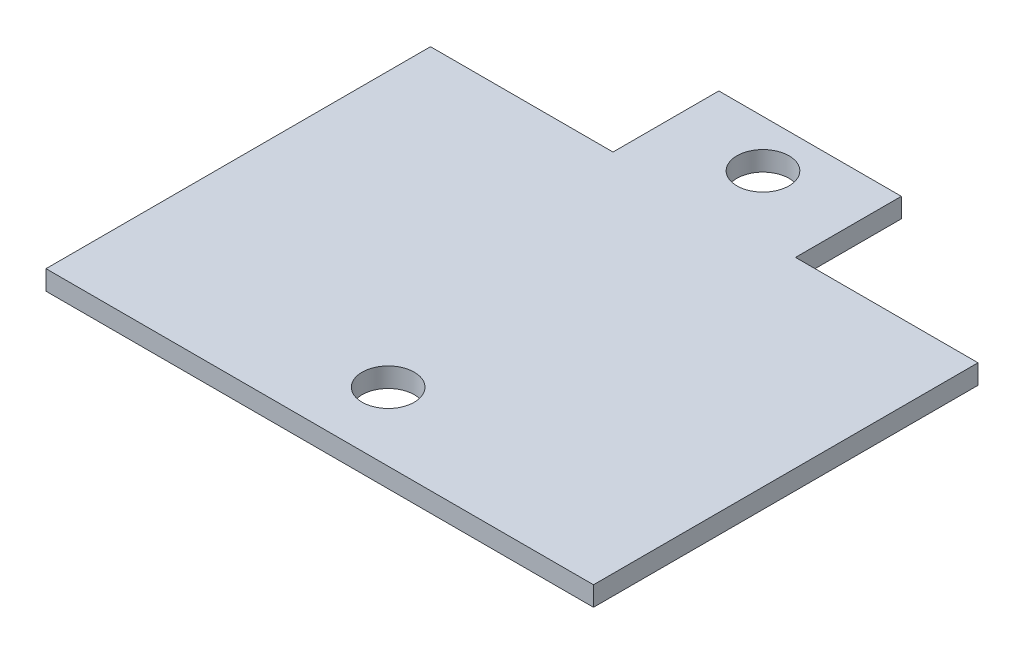
ISO-10303-21;
HEADER;
FILE_DESCRIPTION(('STEP AP214'),'2;1');
FILE_NAME('part.step','',(''),(''),'','','');
FILE_SCHEMA(('AUTOMOTIVE_DESIGN { 1 0 10303 214 1 1 1 1 }'));
ENDSEC;
DATA;
#1=APPLICATION_CONTEXT('core data for automotive mechanical design processes');
#2=APPLICATION_PROTOCOL_DEFINITION('international standard','automotive_design',2000,#1);
#3=PRODUCT_CONTEXT('',#1,'mechanical');
#4=PRODUCT('Part','Part','',(#3));
#5=PRODUCT_RELATED_PRODUCT_CATEGORY('part','',(#4));
#6=PRODUCT_DEFINITION_FORMATION('','',#4);
#7=PRODUCT_DEFINITION_CONTEXT('part definition',#1,'design');
#8=PRODUCT_DEFINITION('design','',#6,#7);
#9=PRODUCT_DEFINITION_SHAPE('','',#8);
#10=(LENGTH_UNIT() NAMED_UNIT(*) SI_UNIT(.MILLI.,.METRE.));
#11=(NAMED_UNIT(*) PLANE_ANGLE_UNIT() SI_UNIT($,.RADIAN.));
#12=(NAMED_UNIT(*) SI_UNIT($,.STERADIAN.) SOLID_ANGLE_UNIT());
#13=UNCERTAINTY_MEASURE_WITH_UNIT(LENGTH_MEASURE(1.E-05),#10,'distance_accuracy_value','');
#14=(GEOMETRIC_REPRESENTATION_CONTEXT(3) GLOBAL_UNCERTAINTY_ASSIGNED_CONTEXT((#13)) GLOBAL_UNIT_ASSIGNED_CONTEXT((#10,
#11,#12)) REPRESENTATION_CONTEXT('',''));
#15=CARTESIAN_POINT('',(0.,0.,0.));
#16=DIRECTION('',(0.,0.,1.));
#17=DIRECTION('',(1.,0.,0.));
#18=AXIS2_PLACEMENT_3D('',#15,#16,#17);
#19=CARTESIAN_POINT('',(0.,1.5,0.));
#20=DIRECTION('',(0.,-1.,0.));
#21=DIRECTION('',(0.,0.,-1.));
#22=AXIS2_PLACEMENT_3D('',#19,#20,#21);
#23=PLANE('',#22);
#24=DIRECTION('',(0.,0.,1.));
#25=VECTOR('',#24,1.);
#26=CARTESIAN_POINT('',(0.,1.5,0.));
#27=LINE('',#26,#25);
#28=CARTESIAN_POINT('',(0.,1.5,-29.4964684047065));
#29=VERTEX_POINT('',#28);
#30=CARTESIAN_POINT('',(0.,1.5,0.));
#31=VERTEX_POINT('',#30);
#32=EDGE_CURVE('E164',#29,#31,#27,.T.);
#33=ORIENTED_EDGE('',*,*,#32,.T.);
#34=DIRECTION('',(1.,0.,0.));
#35=VECTOR('',#34,1.);
#36=CARTESIAN_POINT('',(0.,1.5,0.));
#37=LINE('',#36,#35);
#38=CARTESIAN_POINT('',(42.,1.5,0.));
#39=VERTEX_POINT('',#38);
#40=EDGE_CURVE('E100',#31,#39,#37,.T.);
#41=ORIENTED_EDGE('',*,*,#40,.T.);
#42=DIRECTION('',(0.,0.,-1.));
#43=VECTOR('',#42,1.);
#44=CARTESIAN_POINT('',(42.,1.5,0.));
#45=LINE('',#44,#43);
#46=CARTESIAN_POINT('',(42.,1.5,-29.4964684047065));
#47=VERTEX_POINT('',#46);
#48=EDGE_CURVE('E185',#39,#47,#45,.T.);
#49=ORIENTED_EDGE('',*,*,#48,.T.);
#50=DIRECTION('',(-1.,0.,0.));
#51=VECTOR('',#50,1.);
#52=CARTESIAN_POINT('',(28.,1.5,-29.4964684047065));
#53=LINE('',#52,#51);
#54=CARTESIAN_POINT('',(28.,1.5,-29.4964684047065));
#55=VERTEX_POINT('',#54);
#56=EDGE_CURVE('E199',#47,#55,#53,.T.);
#57=ORIENTED_EDGE('',*,*,#56,.T.);
#58=DIRECTION('',(0.,0.,-1.));
#59=VECTOR('',#58,1.);
#60=CARTESIAN_POINT('',(28.,1.5,-37.6149124070522));
#61=LINE('',#60,#59);
#62=CARTESIAN_POINT('',(28.,1.5,-37.6149124070522));
#63=VERTEX_POINT('',#62);
#64=EDGE_CURVE('E119',#55,#63,#61,.T.);
#65=ORIENTED_EDGE('',*,*,#64,.T.);
#66=DIRECTION('',(-1.,0.,0.));
#67=VECTOR('',#66,1.);
#68=CARTESIAN_POINT('',(14.,1.5,-37.6149124070522));
#69=LINE('',#68,#67);
#70=CARTESIAN_POINT('',(14.,1.5,-37.6149124070522));
#71=VERTEX_POINT('',#70);
#72=EDGE_CURVE('E113',#63,#71,#69,.T.);
#73=ORIENTED_EDGE('',*,*,#72,.T.);
#74=DIRECTION('',(0.,0.,1.));
#75=VECTOR('',#74,1.);
#76=CARTESIAN_POINT('',(14.,1.5,-29.4964684047065));
#77=LINE('',#76,#75);
#78=CARTESIAN_POINT('',(14.,1.5,-29.4964684047065));
#79=VERTEX_POINT('',#78);
#80=EDGE_CURVE('E117',#71,#79,#77,.T.);
#81=ORIENTED_EDGE('',*,*,#80,.T.);
#82=DIRECTION('',(-1.,0.,0.));
#83=VECTOR('',#82,1.);
#84=CARTESIAN_POINT('',(0.,1.5,-29.4964684047065));
#85=LINE('',#84,#83);
#86=EDGE_CURVE('E57',#79,#29,#85,.T.);
#87=ORIENTED_EDGE('',*,*,#86,.T.);
#88=EDGE_LOOP('',(#33,#41,#49,#57,#65,#73,#81,#87));
#89=FACE_BOUND('',#88,.T.);
#90=CARTESIAN_POINT('',(21.,1.5,-34.));
#91=DIRECTION('',(0.,1.,0.));
#92=DIRECTION('',(0.,0.,-1.));
#93=AXIS2_PLACEMENT_3D('',#90,#91,#92);
#94=CIRCLE('',#93,2.00000000000001);
#95=CARTESIAN_POINT('',(21.,1.5,-36.));
#96=VERTEX_POINT('',#95);
#97=EDGE_CURVE('E146',#96,#96,#94,.T.);
#98=ORIENTED_EDGE('',*,*,#97,.F.);
#99=EDGE_LOOP('',(#98));
#100=FACE_BOUND('',#99,.T.);
#101=CARTESIAN_POINT('',(21.,1.5,-5.25));
#102=DIRECTION('',(0.,1.,0.));
#103=DIRECTION('',(0.,0.,-1.));
#104=AXIS2_PLACEMENT_3D('',#101,#102,#103);
#105=CIRCLE('',#104,2.);
#106=CARTESIAN_POINT('',(21.,1.5,-7.25));
#107=VERTEX_POINT('',#106);
#108=EDGE_CURVE('E213',#107,#107,#105,.T.);
#109=ORIENTED_EDGE('',*,*,#108,.F.);
#110=EDGE_LOOP('',(#109));
#111=FACE_BOUND('',#110,.T.);
#112=ADVANCED_FACE('F39',(#89,#100,#111),#23,.F.);
#113=CARTESIAN_POINT('',(0.,0.,0.));
#114=DIRECTION('',(0.,-1.,0.));
#115=DIRECTION('',(0.,0.,-1.));
#116=AXIS2_PLACEMENT_3D('',#113,#114,#115);
#117=PLANE('',#116);
#118=CARTESIAN_POINT('',(21.,0.,-34.));
#119=DIRECTION('',(0.,1.,0.));
#120=DIRECTION('',(0.,0.,-1.));
#121=AXIS2_PLACEMENT_3D('',#118,#119,#120);
#122=CIRCLE('',#121,2.00000000000001);
#123=CARTESIAN_POINT('',(21.,0.,-36.));
#124=VERTEX_POINT('',#123);
#125=EDGE_CURVE('E209',#124,#124,#122,.T.);
#126=ORIENTED_EDGE('',*,*,#125,.T.);
#127=EDGE_LOOP('',(#126));
#128=FACE_BOUND('',#127,.T.);
#129=DIRECTION('',(0.,0.,1.));
#130=VECTOR('',#129,1.);
#131=CARTESIAN_POINT('',(0.,0.,0.));
#132=LINE('',#131,#130);
#133=CARTESIAN_POINT('',(0.,0.,-29.4964684047065));
#134=VERTEX_POINT('',#133);
#135=CARTESIAN_POINT('',(0.,0.,0.));
#136=VERTEX_POINT('',#135);
#137=EDGE_CURVE('E141',#134,#136,#132,.T.);
#138=ORIENTED_EDGE('',*,*,#137,.F.);
#139=DIRECTION('',(-1.,0.,0.));
#140=VECTOR('',#139,1.);
#141=CARTESIAN_POINT('',(0.,0.,-29.4964684047065));
#142=LINE('',#141,#140);
#143=CARTESIAN_POINT('',(14.,0.,-29.4964684047065));
#144=VERTEX_POINT('',#143);
#145=EDGE_CURVE('E92',#144,#134,#142,.T.);
#146=ORIENTED_EDGE('',*,*,#145,.F.);
#147=DIRECTION('',(0.,0.,1.));
#148=VECTOR('',#147,1.);
#149=CARTESIAN_POINT('',(14.,0.,-29.4964684047065));
#150=LINE('',#149,#148);
#151=CARTESIAN_POINT('',(14.,0.,-37.6149124070522));
#152=VERTEX_POINT('',#151);
#153=EDGE_CURVE('E86',#152,#144,#150,.T.);
#154=ORIENTED_EDGE('',*,*,#153,.F.);
#155=DIRECTION('',(-1.,0.,0.));
#156=VECTOR('',#155,1.);
#157=CARTESIAN_POINT('',(14.,0.,-37.6149124070522));
#158=LINE('',#157,#156);
#159=CARTESIAN_POINT('',(28.,0.,-37.6149124070522));
#160=VERTEX_POINT('',#159);
#161=EDGE_CURVE('E128',#160,#152,#158,.T.);
#162=ORIENTED_EDGE('',*,*,#161,.F.);
#163=DIRECTION('',(0.,0.,-1.));
#164=VECTOR('',#163,1.);
#165=CARTESIAN_POINT('',(28.,0.,-37.6149124070522));
#166=LINE('',#165,#164);
#167=CARTESIAN_POINT('',(28.,0.,-29.4964684047065));
#168=VERTEX_POINT('',#167);
#169=EDGE_CURVE('E155',#168,#160,#166,.T.);
#170=ORIENTED_EDGE('',*,*,#169,.F.);
#171=DIRECTION('',(-1.,0.,0.));
#172=VECTOR('',#171,1.);
#173=CARTESIAN_POINT('',(28.,0.,-29.4964684047065));
#174=LINE('',#173,#172);
#175=CARTESIAN_POINT('',(42.,0.,-29.4964684047065));
#176=VERTEX_POINT('',#175);
#177=EDGE_CURVE('E152',#176,#168,#174,.T.);
#178=ORIENTED_EDGE('',*,*,#177,.F.);
#179=DIRECTION('',(0.,0.,-1.));
#180=VECTOR('',#179,1.);
#181=CARTESIAN_POINT('',(42.,0.,0.));
#182=LINE('',#181,#180);
#183=CARTESIAN_POINT('',(42.,0.,0.));
#184=VERTEX_POINT('',#183);
#185=EDGE_CURVE('E149',#184,#176,#182,.T.);
#186=ORIENTED_EDGE('',*,*,#185,.F.);
#187=DIRECTION('',(1.,0.,0.));
#188=VECTOR('',#187,1.);
#189=CARTESIAN_POINT('',(0.,0.,0.));
#190=LINE('',#189,#188);
#191=EDGE_CURVE('E145',#136,#184,#190,.T.);
#192=ORIENTED_EDGE('',*,*,#191,.F.);
#193=EDGE_LOOP('',(#138,#146,#154,#162,#170,#178,#186,#192));
#194=FACE_BOUND('',#193,.T.);
#195=CARTESIAN_POINT('',(21.,0.,-5.25));
#196=DIRECTION('',(0.,1.,0.));
#197=DIRECTION('',(0.,0.,-1.));
#198=AXIS2_PLACEMENT_3D('',#195,#196,#197);
#199=CIRCLE('',#198,2.);
#200=CARTESIAN_POINT('',(21.,0.,-7.25));
#201=VERTEX_POINT('',#200);
#202=EDGE_CURVE('E217',#201,#201,#199,.T.);
#203=ORIENTED_EDGE('',*,*,#202,.T.);
#204=EDGE_LOOP('',(#203));
#205=FACE_BOUND('',#204,.T.);
#206=ADVANCED_FACE('F189',(#128,#194,#205),#117,.T.);
#207=CARTESIAN_POINT('',(0.,1.5,0.));
#208=DIRECTION('',(1.,0.,0.));
#209=DIRECTION('',(0.,0.,-1.));
#210=AXIS2_PLACEMENT_3D('',#207,#208,#209);
#211=PLANE('',#210);
#212=ORIENTED_EDGE('',*,*,#137,.T.);
#213=DIRECTION('',(0.,-1.,0.));
#214=VECTOR('',#213,1.);
#215=CARTESIAN_POINT('',(0.,1.5,0.));
#216=LINE('',#215,#214);
#217=EDGE_CURVE('E11',#31,#136,#216,.T.);
#218=ORIENTED_EDGE('',*,*,#217,.F.);
#219=ORIENTED_EDGE('',*,*,#32,.F.);
#220=DIRECTION('',(0.,-1.,0.));
#221=VECTOR('',#220,1.);
#222=CARTESIAN_POINT('',(0.,1.5,-29.4964684047065));
#223=LINE('',#222,#221);
#224=EDGE_CURVE('E137',#29,#134,#223,.T.);
#225=ORIENTED_EDGE('',*,*,#224,.T.);
#226=EDGE_LOOP('',(#212,#218,#219,#225));
#227=FACE_BOUND('',#226,.T.);
#228=ADVANCED_FACE('F41',(#227),#211,.F.);
#229=CARTESIAN_POINT('',(0.,1.5,0.));
#230=DIRECTION('',(0.,0.,-1.));
#231=DIRECTION('',(-1.,0.,0.));
#232=AXIS2_PLACEMENT_3D('',#229,#230,#231);
#233=PLANE('',#232);
#234=ORIENTED_EDGE('',*,*,#191,.T.);
#235=DIRECTION('',(0.,-1.,0.));
#236=VECTOR('',#235,1.);
#237=CARTESIAN_POINT('',(42.,1.5,0.));
#238=LINE('',#237,#236);
#239=EDGE_CURVE('E49',#39,#184,#238,.T.);
#240=ORIENTED_EDGE('',*,*,#239,.F.);
#241=ORIENTED_EDGE('',*,*,#40,.F.);
#242=ORIENTED_EDGE('',*,*,#217,.T.);
#243=EDGE_LOOP('',(#234,#240,#241,#242));
#244=FACE_BOUND('',#243,.T.);
#245=ADVANCED_FACE('F251',(#244),#233,.F.);
#246=CARTESIAN_POINT('',(42.,1.5,0.));
#247=DIRECTION('',(-1.,0.,0.));
#248=DIRECTION('',(0.,0.,1.));
#249=AXIS2_PLACEMENT_3D('',#246,#247,#248);
#250=PLANE('',#249);
#251=ORIENTED_EDGE('',*,*,#185,.T.);
#252=DIRECTION('',(0.,-1.,0.));
#253=VECTOR('',#252,1.);
#254=CARTESIAN_POINT('',(42.,1.5,-29.4964684047065));
#255=LINE('',#254,#253);
#256=EDGE_CURVE('E175',#47,#176,#255,.T.);
#257=ORIENTED_EDGE('',*,*,#256,.F.);
#258=ORIENTED_EDGE('',*,*,#48,.F.);
#259=ORIENTED_EDGE('',*,*,#239,.T.);
#260=EDGE_LOOP('',(#251,#257,#258,#259));
#261=FACE_BOUND('',#260,.T.);
#262=ADVANCED_FACE('F183',(#261),#250,.F.);
#263=CARTESIAN_POINT('',(28.,1.5,-29.4964684047065));
#264=DIRECTION('',(0.,0.,1.));
#265=DIRECTION('',(1.,0.,0.));
#266=AXIS2_PLACEMENT_3D('',#263,#264,#265);
#267=PLANE('',#266);
#268=ORIENTED_EDGE('',*,*,#177,.T.);
#269=DIRECTION('',(0.,-1.,0.));
#270=VECTOR('',#269,1.);
#271=CARTESIAN_POINT('',(28.,1.5,-29.4964684047065));
#272=LINE('',#271,#270);
#273=EDGE_CURVE('E171',#55,#168,#272,.T.);
#274=ORIENTED_EDGE('',*,*,#273,.F.);
#275=ORIENTED_EDGE('',*,*,#56,.F.);
#276=ORIENTED_EDGE('',*,*,#256,.T.);
#277=EDGE_LOOP('',(#268,#274,#275,#276));
#278=FACE_BOUND('',#277,.T.);
#279=ADVANCED_FACE('F194',(#278),#267,.F.);
#280=CARTESIAN_POINT('',(28.,1.5,-37.6149124070522));
#281=DIRECTION('',(-1.,0.,0.));
#282=DIRECTION('',(0.,0.,1.));
#283=AXIS2_PLACEMENT_3D('',#280,#281,#282);
#284=PLANE('',#283);
#285=ORIENTED_EDGE('',*,*,#169,.T.);
#286=DIRECTION('',(0.,-1.,0.));
#287=VECTOR('',#286,1.);
#288=CARTESIAN_POINT('',(28.,1.5,-37.6149124070522));
#289=LINE('',#288,#287);
#290=EDGE_CURVE('E130',#63,#160,#289,.T.);
#291=ORIENTED_EDGE('',*,*,#290,.F.);
#292=ORIENTED_EDGE('',*,*,#64,.F.);
#293=ORIENTED_EDGE('',*,*,#273,.T.);
#294=EDGE_LOOP('',(#285,#291,#292,#293));
#295=FACE_BOUND('',#294,.T.);
#296=ADVANCED_FACE('F197',(#295),#284,.F.);
#297=CARTESIAN_POINT('',(14.,1.5,-37.6149124070522));
#298=DIRECTION('',(0.,0.,1.));
#299=DIRECTION('',(1.,0.,0.));
#300=AXIS2_PLACEMENT_3D('',#297,#298,#299);
#301=PLANE('',#300);
#302=ORIENTED_EDGE('',*,*,#161,.T.);
#303=DIRECTION('',(0.,-1.,0.));
#304=VECTOR('',#303,1.);
#305=CARTESIAN_POINT('',(14.,1.5,-37.6149124070522));
#306=LINE('',#305,#304);
#307=EDGE_CURVE('E125',#71,#152,#306,.T.);
#308=ORIENTED_EDGE('',*,*,#307,.F.);
#309=ORIENTED_EDGE('',*,*,#72,.F.);
#310=ORIENTED_EDGE('',*,*,#290,.T.);
#311=EDGE_LOOP('',(#302,#308,#309,#310));
#312=FACE_BOUND('',#311,.T.);
#313=ADVANCED_FACE('F126',(#312),#301,.F.);
#314=CARTESIAN_POINT('',(14.,1.5,-29.4964684047065));
#315=DIRECTION('',(1.,0.,0.));
#316=DIRECTION('',(0.,0.,-1.));
#317=AXIS2_PLACEMENT_3D('',#314,#315,#316);
#318=PLANE('',#317);
#319=ORIENTED_EDGE('',*,*,#153,.T.);
#320=DIRECTION('',(0.,-1.,0.));
#321=VECTOR('',#320,1.);
#322=CARTESIAN_POINT('',(14.,1.5,-29.4964684047065));
#323=LINE('',#322,#321);
#324=EDGE_CURVE('E131',#79,#144,#323,.T.);
#325=ORIENTED_EDGE('',*,*,#324,.F.);
#326=ORIENTED_EDGE('',*,*,#80,.F.);
#327=ORIENTED_EDGE('',*,*,#307,.T.);
#328=EDGE_LOOP('',(#319,#325,#326,#327));
#329=FACE_BOUND('',#328,.T.);
#330=ADVANCED_FACE('F133',(#329),#318,.F.);
#331=CARTESIAN_POINT('',(0.,1.5,-29.4964684047065));
#332=DIRECTION('',(0.,0.,1.));
#333=DIRECTION('',(1.,0.,0.));
#334=AXIS2_PLACEMENT_3D('',#331,#332,#333);
#335=PLANE('',#334);
#336=ORIENTED_EDGE('',*,*,#145,.T.);
#337=ORIENTED_EDGE('',*,*,#224,.F.);
#338=ORIENTED_EDGE('',*,*,#86,.F.);
#339=ORIENTED_EDGE('',*,*,#324,.T.);
#340=EDGE_LOOP('',(#336,#337,#338,#339));
#341=FACE_BOUND('',#340,.T.);
#342=ADVANCED_FACE('F239',(#341),#335,.F.);
#343=CARTESIAN_POINT('',(21.,1.5,-34.));
#344=DIRECTION('',(0.,-1.,0.));
#345=DIRECTION('',(0.,0.,-1.));
#346=AXIS2_PLACEMENT_3D('',#343,#344,#345);
#347=CYLINDRICAL_SURFACE('',#346,2.00000000000001);
#348=ORIENTED_EDGE('',*,*,#97,.T.);
#349=EDGE_LOOP('',(#348));
#350=FACE_BOUND('',#349,.T.);
#351=ORIENTED_EDGE('',*,*,#125,.F.);
#352=EDGE_LOOP('',(#351));
#353=FACE_BOUND('',#352,.T.);
#354=ADVANCED_FACE('F236',(#350,#353),#347,.F.);
#355=CARTESIAN_POINT('',(21.,1.5,-5.25));
#356=DIRECTION('',(0.,-1.,0.));
#357=DIRECTION('',(0.,0.,-1.));
#358=AXIS2_PLACEMENT_3D('',#355,#356,#357);
#359=CYLINDRICAL_SURFACE('',#358,2.);
#360=ORIENTED_EDGE('',*,*,#108,.T.);
#361=EDGE_LOOP('',(#360));
#362=FACE_BOUND('',#361,.T.);
#363=ORIENTED_EDGE('',*,*,#202,.F.);
#364=EDGE_LOOP('',(#363));
#365=FACE_BOUND('',#364,.T.);
#366=ADVANCED_FACE('F225',(#362,#365),#359,.F.);
#367=CLOSED_SHELL('',(#112,#206,#228,#245,#262,#279,#296,#313,#330,#342,#354,#366));
#368=MANIFOLD_SOLID_BREP('B2',#367);
#369=ADVANCED_BREP_SHAPE_REPRESENTATION('',(#18,#368),#14);
#370=SHAPE_DEFINITION_REPRESENTATION(#9,#369);
ENDSEC;
END-ISO-10303-21;
